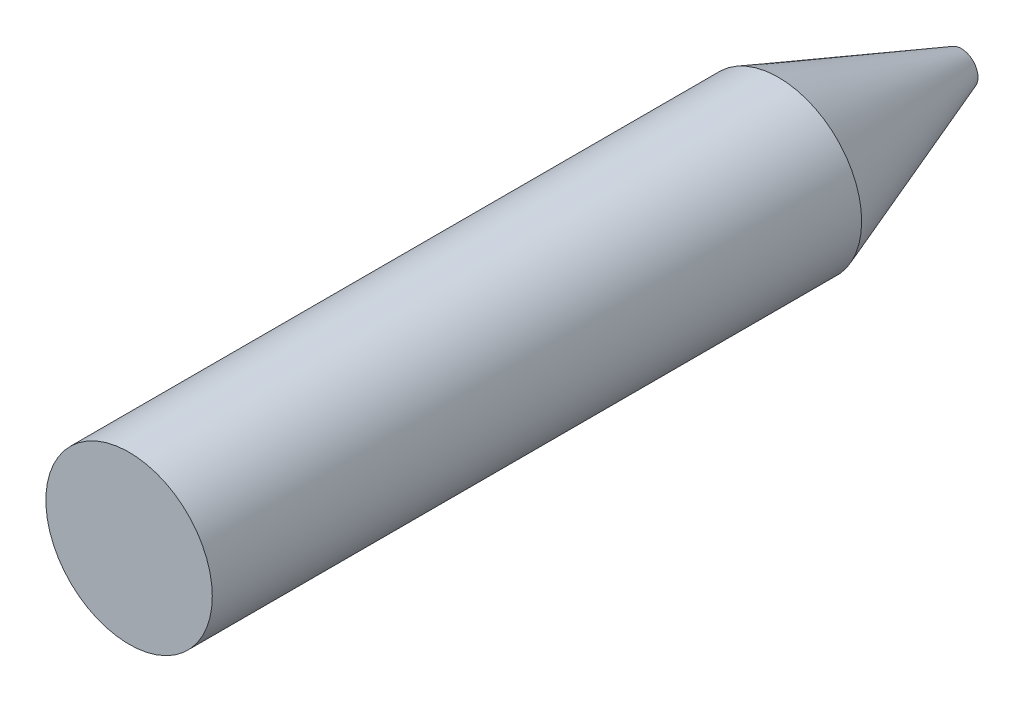
ISO-10303-21;
HEADER;
FILE_DESCRIPTION(('STEP AP214'),'2;1');
FILE_NAME('part.step','',(''),(''),'','','');
FILE_SCHEMA(('AUTOMOTIVE_DESIGN { 1 0 10303 214 1 1 1 1 }'));
ENDSEC;
DATA;
#1=APPLICATION_CONTEXT('core data for automotive mechanical design processes');
#2=APPLICATION_PROTOCOL_DEFINITION('international standard','automotive_design',2000,#1);
#3=PRODUCT_CONTEXT('',#1,'mechanical');
#4=PRODUCT('Part','Part','',(#3));
#5=PRODUCT_RELATED_PRODUCT_CATEGORY('part','',(#4));
#6=PRODUCT_DEFINITION_FORMATION('','',#4);
#7=PRODUCT_DEFINITION_CONTEXT('part definition',#1,'design');
#8=PRODUCT_DEFINITION('design','',#6,#7);
#9=PRODUCT_DEFINITION_SHAPE('','',#8);
#10=(LENGTH_UNIT() NAMED_UNIT(*) SI_UNIT(.MILLI.,.METRE.));
#11=(NAMED_UNIT(*) PLANE_ANGLE_UNIT() SI_UNIT($,.RADIAN.));
#12=(NAMED_UNIT(*) SI_UNIT($,.STERADIAN.) SOLID_ANGLE_UNIT());
#13=UNCERTAINTY_MEASURE_WITH_UNIT(LENGTH_MEASURE(1.E-05),#10,'distance_accuracy_value','');
#14=(GEOMETRIC_REPRESENTATION_CONTEXT(3) GLOBAL_UNCERTAINTY_ASSIGNED_CONTEXT((#13)) GLOBAL_UNIT_ASSIGNED_CONTEXT((#10,
#11,#12)) REPRESENTATION_CONTEXT('',''));
#15=CARTESIAN_POINT('',(0.,0.,0.));
#16=DIRECTION('',(0.,0.,1.));
#17=DIRECTION('',(1.,0.,0.));
#18=AXIS2_PLACEMENT_3D('',#15,#16,#17);
#19=CARTESIAN_POINT('',(0.,0.,0.));
#20=DIRECTION('',(0.,0.,1.));
#21=DIRECTION('',(1.,0.,0.));
#22=AXIS2_PLACEMENT_3D('',#19,#20,#21);
#23=PLANE('',#22);
#24=CARTESIAN_POINT('',(0.,0.,0.));
#25=DIRECTION('',(0.,0.,1.));
#26=DIRECTION('',(1.,0.,0.));
#27=AXIS2_PLACEMENT_3D('',#24,#25,#26);
#28=CIRCLE('',#27,10.);
#29=CARTESIAN_POINT('',(10.,0.,0.));
#30=VERTEX_POINT('',#29);
#31=EDGE_CURVE('E10',#30,#30,#28,.T.);
#32=ORIENTED_EDGE('',*,*,#31,.T.);
#33=EDGE_LOOP('',(#32));
#34=FACE_BOUND('',#33,.T.);
#35=ADVANCED_FACE('F31',(#34),#23,.T.);
#36=CARTESIAN_POINT('',(0.,0.,68.6931684040079));
#37=DIRECTION('',(0.,0.,1.));
#38=DIRECTION('',(1.,0.,0.));
#39=AXIS2_PLACEMENT_3D('',#36,#37,#38);
#40=CYLINDRICAL_SURFACE('',#39,10.);
#41=CARTESIAN_POINT('',(0.,0.,-78.0201806443631));
#42=DIRECTION('',(0.,0.,1.));
#43=DIRECTION('',(1.,0.,0.));
#44=AXIS2_PLACEMENT_3D('',#41,#42,#43);
#45=CIRCLE('',#44,10.);
#46=CARTESIAN_POINT('',(10.,0.,-78.0201806443631));
#47=VERTEX_POINT('',#46);
#48=EDGE_CURVE('E37',#47,#47,#45,.T.);
#49=ORIENTED_EDGE('',*,*,#48,.T.);
#50=EDGE_LOOP('',(#49));
#51=FACE_BOUND('',#50,.T.);
#52=ORIENTED_EDGE('',*,*,#31,.F.);
#53=EDGE_LOOP('',(#52));
#54=FACE_BOUND('',#53,.T.);
#55=ADVANCED_FACE('F57',(#51,#54),#40,.T.);
#56=CARTESIAN_POINT('',(0.,0.,-78.0201806443631));
#57=DIRECTION('',(0.,0.,1.));
#58=DIRECTION('',(1.,0.,0.));
#59=AXIS2_PLACEMENT_3D('',#56,#57,#58);
#60=CONICAL_SURFACE('',#59,10.,0.349065850398866);
#61=CARTESIAN_POINT('',(0.,0.,-100.));
#62=DIRECTION('',(0.,0.,1.));
#63=DIRECTION('',(1.,0.,0.));
#64=AXIS2_PLACEMENT_3D('',#61,#62,#63);
#65=CIRCLE('',#64,2.);
#66=CARTESIAN_POINT('',(2.,0.,-100.));
#67=VERTEX_POINT('',#66);
#68=EDGE_CURVE('E41',#67,#67,#65,.T.);
#69=ORIENTED_EDGE('',*,*,#68,.T.);
#70=EDGE_LOOP('',(#69));
#71=FACE_BOUND('',#70,.T.);
#72=ORIENTED_EDGE('',*,*,#48,.F.);
#73=EDGE_LOOP('',(#72));
#74=FACE_BOUND('',#73,.T.);
#75=ADVANCED_FACE('F48',(#71,#74),#60,.T.);
#76=CARTESIAN_POINT('',(2.,0.,-100.));
#77=DIRECTION('',(0.,0.,-1.));
#78=DIRECTION('',(-1.,0.,0.));
#79=AXIS2_PLACEMENT_3D('',#76,#77,#78);
#80=PLANE('',#79);
#81=ORIENTED_EDGE('',*,*,#68,.F.);
#82=EDGE_LOOP('',(#81));
#83=FACE_BOUND('',#82,.T.);
#84=ADVANCED_FACE('F51',(#83),#80,.T.);
#85=CLOSED_SHELL('',(#35,#55,#75,#84));
#86=MANIFOLD_SOLID_BREP('B2',#85);
#87=ADVANCED_BREP_SHAPE_REPRESENTATION('',(#18,#86),#14);
#88=SHAPE_DEFINITION_REPRESENTATION(#9,#87);
ENDSEC;
END-ISO-10303-21;
